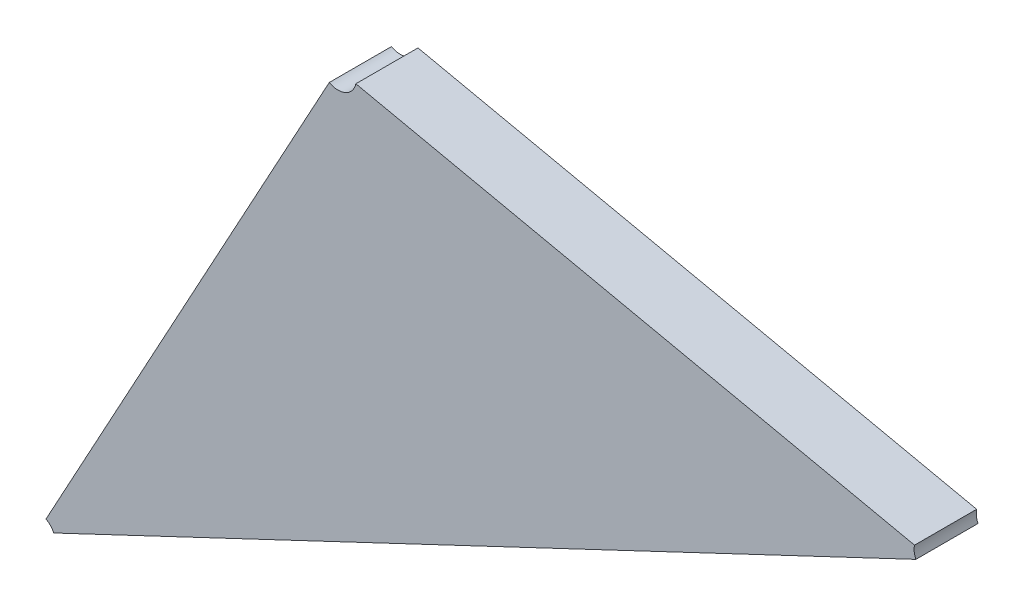
ISO-10303-21;
HEADER;
FILE_DESCRIPTION(('STEP AP214'),'2;1');
FILE_NAME('part.step','',(''),(''),'','','');
FILE_SCHEMA(('AUTOMOTIVE_DESIGN { 1 0 10303 214 1 1 1 1 }'));
ENDSEC;
DATA;
#1=APPLICATION_CONTEXT('core data for automotive mechanical design processes');
#2=APPLICATION_PROTOCOL_DEFINITION('international standard','automotive_design',2000,#1);
#3=PRODUCT_CONTEXT('',#1,'mechanical');
#4=PRODUCT('Part','Part','',(#3));
#5=PRODUCT_RELATED_PRODUCT_CATEGORY('part','',(#4));
#6=PRODUCT_DEFINITION_FORMATION('','',#4);
#7=PRODUCT_DEFINITION_CONTEXT('part definition',#1,'design');
#8=PRODUCT_DEFINITION('design','',#6,#7);
#9=PRODUCT_DEFINITION_SHAPE('','',#8);
#10=(LENGTH_UNIT() NAMED_UNIT(*) SI_UNIT(.MILLI.,.METRE.));
#11=(NAMED_UNIT(*) PLANE_ANGLE_UNIT() SI_UNIT($,.RADIAN.));
#12=(NAMED_UNIT(*) SI_UNIT($,.STERADIAN.) SOLID_ANGLE_UNIT());
#13=UNCERTAINTY_MEASURE_WITH_UNIT(LENGTH_MEASURE(1.E-05),#10,'distance_accuracy_value','');
#14=(GEOMETRIC_REPRESENTATION_CONTEXT(3) GLOBAL_UNCERTAINTY_ASSIGNED_CONTEXT((#13)) GLOBAL_UNIT_ASSIGNED_CONTEXT((#10,
#11,#12)) REPRESENTATION_CONTEXT('',''));
#15=CARTESIAN_POINT('',(0.,0.,0.));
#16=DIRECTION('',(0.,0.,1.));
#17=DIRECTION('',(1.,0.,0.));
#18=AXIS2_PLACEMENT_3D('',#15,#16,#17);
#19=CARTESIAN_POINT('',(-1.36985854212353,-1.36074278433117,0.0042));
#20=DIRECTION('',(0.,0.,1.));
#21=DIRECTION('',(1.,0.,0.));
#22=AXIS2_PLACEMENT_3D('',#19,#20,#21);
#23=PLANE('',#22);
#24=CARTESIAN_POINT('',(-1.37552796514819,-1.34730973343148,0.0042));
#25=DIRECTION('',(0.,0.,-1.));
#26=DIRECTION('',(0.977619939969203,-0.210378832049739,0.));
#27=AXIS2_PLACEMENT_3D('',#24,#25,#26);
#28=CIRCLE('',#27,0.000999999999999999);
#29=CARTESIAN_POINT('',(-1.37455034520822,-1.34752011226353,0.0042));
#30=VERTEX_POINT('',#29);
#31=CARTESIAN_POINT('',(-1.37600655354297,-1.34818777280894,0.0042));
#32=VERTEX_POINT('',#31);
#33=EDGE_CURVE('E11',#30,#32,#28,.T.);
#34=ORIENTED_EDGE('',*,*,#33,.T.);
#35=DIRECTION('',(-0.478588394782354,-0.878039377465299,0.));
#36=VECTOR('',#35,1.);
#37=CARTESIAN_POINT('',(-1.37600655354297,-1.34818777280894,0.0042));
#38=LINE('',#37,#36);
#39=CARTESIAN_POINT('',(-1.39151040841025,-1.37663182875428,0.0042));
#40=VERTEX_POINT('',#39);
#41=EDGE_CURVE('E34',#32,#40,#38,.T.);
#42=ORIENTED_EDGE('',*,*,#41,.T.);
#43=CARTESIAN_POINT('',(-1.39198899680504,-1.37750986813174,0.0042));
#44=DIRECTION('',(0.,0.,-1.));
#45=DIRECTION('',(0.478588394790645,0.87803937746078,0.));
#46=AXIS2_PLACEMENT_3D('',#43,#44,#45);
#47=CIRCLE('',#46,0.000999999999999994);
#48=CARTESIAN_POINT('',(-1.39108519040706,-1.37708192655281,0.0042));
#49=VERTEX_POINT('',#48);
#50=EDGE_CURVE('E86',#40,#49,#47,.T.);
#51=ORIENTED_EDGE('',*,*,#50,.T.);
#52=DIRECTION('',(0.903806397975919,0.42794157893081,0.));
#53=VECTOR('',#52,1.);
#54=CARTESIAN_POINT('',(-1.39108519040706,-1.37708192655281,0.0042));
#55=LINE('',#54,#53);
#56=CARTESIAN_POINT('',(-1.34389716330072,-1.35473895700564,0.0042));
#57=VERTEX_POINT('',#56);
#58=EDGE_CURVE('E105',#49,#57,#55,.T.);
#59=ORIENTED_EDGE('',*,*,#58,.T.);
#60=CARTESIAN_POINT('',(-1.34299335690274,-1.35431101542671,0.0042));
#61=DIRECTION('',(0.,0.,-1.));
#62=DIRECTION('',(-0.90380639797689,-0.427941578928759,0.));
#63=AXIS2_PLACEMENT_3D('',#60,#61,#62);
#64=CIRCLE('',#63,0.00100000000000002);
#65=CARTESIAN_POINT('',(-1.34397097684271,-1.35410063659466,0.0042));
#66=VERTEX_POINT('',#65);
#67=EDGE_CURVE('E110',#57,#66,#64,.T.);
#68=ORIENTED_EDGE('',*,*,#67,.T.);
#69=DIRECTION('',(-0.977619939969144,0.210378832050012,0.));
#70=VECTOR('',#69,1.);
#71=CARTESIAN_POINT('',(-1.34397097684271,-1.35410063659466,0.0042));
#72=LINE('',#71,#70);
#73=EDGE_CURVE('E85',#66,#30,#72,.T.);
#74=ORIENTED_EDGE('',*,*,#73,.T.);
#75=EDGE_LOOP('',(#34,#42,#51,#59,#68,#74));
#76=FACE_BOUND('',#75,.T.);
#77=ADVANCED_FACE('F17',(#76),#23,.T.);
#78=CARTESIAN_POINT('',(-1.37552796514819,-1.34730973343148,0.0012));
#79=DIRECTION('',(0.,0.,1.));
#80=DIRECTION('',(-1.,0.,0.));
#81=AXIS2_PLACEMENT_3D('',#78,#79,#80);
#82=CYLINDRICAL_SURFACE('',#81,0.000999999999999999);
#83=DIRECTION('',(0.,0.,-1.));
#84=VECTOR('',#83,1.);
#85=CARTESIAN_POINT('',(-1.37600655354297,-1.34818777280894,0.0042));
#86=LINE('',#85,#84);
#87=CARTESIAN_POINT('',(-1.37600655354297,-1.34818777280894,0.0008));
#88=VERTEX_POINT('',#87);
#89=EDGE_CURVE('E24',#32,#88,#86,.T.);
#90=ORIENTED_EDGE('',*,*,#89,.F.);
#91=ORIENTED_EDGE('',*,*,#33,.F.);
#92=DIRECTION('',(0.,0.,1.));
#93=VECTOR('',#92,1.);
#94=CARTESIAN_POINT('',(-1.37455034520822,-1.34752011226353,0.0008));
#95=LINE('',#94,#93);
#96=CARTESIAN_POINT('',(-1.37455034520822,-1.34752011226353,0.0008));
#97=VERTEX_POINT('',#96);
#98=EDGE_CURVE('E108',#97,#30,#95,.T.);
#99=ORIENTED_EDGE('',*,*,#98,.F.);
#100=CARTESIAN_POINT('',(-1.37552796514819,-1.34730973343148,0.0008));
#101=DIRECTION('',(0.,0.,1.));
#102=DIRECTION('',(-0.478588394782881,-0.878039377465012,0.));
#103=AXIS2_PLACEMENT_3D('',#100,#101,#102);
#104=CIRCLE('',#103,0.000999999999999999);
#105=EDGE_CURVE('E91',#88,#97,#104,.T.);
#106=ORIENTED_EDGE('',*,*,#105,.F.);
#107=EDGE_LOOP('',(#90,#91,#99,#106));
#108=FACE_BOUND('',#107,.T.);
#109=ADVANCED_FACE('F128',(#108),#82,.F.);
#110=CARTESIAN_POINT('',(-1.34299335690274,-1.35431101542671,0.0012));
#111=DIRECTION('',(0.,0.,1.));
#112=DIRECTION('',(-1.,0.,0.));
#113=AXIS2_PLACEMENT_3D('',#110,#111,#112);
#114=CYLINDRICAL_SURFACE('',#113,0.00100000000000002);
#115=DIRECTION('',(0.,0.,-1.));
#116=VECTOR('',#115,1.);
#117=CARTESIAN_POINT('',(-1.34397097684271,-1.35410063659466,0.0042));
#118=LINE('',#117,#116);
#119=CARTESIAN_POINT('',(-1.34397097684271,-1.35410063659466,0.0008));
#120=VERTEX_POINT('',#119);
#121=EDGE_CURVE('E68',#66,#120,#118,.T.);
#122=ORIENTED_EDGE('',*,*,#121,.F.);
#123=ORIENTED_EDGE('',*,*,#67,.F.);
#124=DIRECTION('',(0.,0.,1.));
#125=VECTOR('',#124,1.);
#126=CARTESIAN_POINT('',(-1.34389716330072,-1.35473895700564,0.0008));
#127=LINE('',#126,#125);
#128=CARTESIAN_POINT('',(-1.34389716330072,-1.35473895700564,0.0008));
#129=VERTEX_POINT('',#128);
#130=EDGE_CURVE('E71',#129,#57,#127,.T.);
#131=ORIENTED_EDGE('',*,*,#130,.F.);
#132=CARTESIAN_POINT('',(-1.34299335690274,-1.35431101542671,0.0008));
#133=DIRECTION('',(0.,0.,1.));
#134=DIRECTION('',(-0.977619939969193,0.210378832049784,0.));
#135=AXIS2_PLACEMENT_3D('',#132,#133,#134);
#136=CIRCLE('',#135,0.00100000000000002);
#137=EDGE_CURVE('E65',#120,#129,#136,.T.);
#138=ORIENTED_EDGE('',*,*,#137,.F.);
#139=EDGE_LOOP('',(#122,#123,#131,#138));
#140=FACE_BOUND('',#139,.T.);
#141=ADVANCED_FACE('F67',(#140),#114,.F.);
#142=CARTESIAN_POINT('',(-1.39198899680504,-1.37750986813174,0.0012));
#143=DIRECTION('',(0.,0.,1.));
#144=DIRECTION('',(-1.,0.,0.));
#145=AXIS2_PLACEMENT_3D('',#142,#143,#144);
#146=CYLINDRICAL_SURFACE('',#145,0.000999999999999994);
#147=DIRECTION('',(0.,0.,1.));
#148=VECTOR('',#147,1.);
#149=CARTESIAN_POINT('',(-1.39151040841025,-1.37663182875428,0.0008));
#150=LINE('',#149,#148);
#151=CARTESIAN_POINT('',(-1.39151040841025,-1.37663182875428,0.0008));
#152=VERTEX_POINT('',#151);
#153=EDGE_CURVE('E112',#152,#40,#150,.T.);
#154=ORIENTED_EDGE('',*,*,#153,.F.);
#155=CARTESIAN_POINT('',(-1.39198899680504,-1.37750986813174,0.0008));
#156=DIRECTION('',(0.,0.,1.));
#157=DIRECTION('',(0.903806397976976,0.427941578928578,0.));
#158=AXIS2_PLACEMENT_3D('',#155,#156,#157);
#159=CIRCLE('',#158,0.000999999999999994);
#160=CARTESIAN_POINT('',(-1.39108519040706,-1.37708192655281,0.0008));
#161=VERTEX_POINT('',#160);
#162=EDGE_CURVE('E102',#161,#152,#159,.T.);
#163=ORIENTED_EDGE('',*,*,#162,.F.);
#164=DIRECTION('',(0.,0.,1.));
#165=VECTOR('',#164,1.);
#166=CARTESIAN_POINT('',(-1.39108519040706,-1.37708192655281,0.0008));
#167=LINE('',#166,#165);
#168=EDGE_CURVE('E76',#161,#49,#167,.T.);
#169=ORIENTED_EDGE('',*,*,#168,.T.);
#170=ORIENTED_EDGE('',*,*,#50,.F.);
#171=EDGE_LOOP('',(#154,#163,#169,#170));
#172=FACE_BOUND('',#171,.T.);
#173=ADVANCED_FACE('F123',(#172),#146,.F.);
#174=CARTESIAN_POINT('',(-1.37552796514819,-1.34730973343148,0.0008));
#175=DIRECTION('',(-0.210378832050013,-0.977619939969144,0.));
#176=DIRECTION('',(0.977619939969144,-0.210378832050013,0.));
#177=AXIS2_PLACEMENT_3D('',#174,#175,#176);
#178=PLANE('',#177);
#179=ORIENTED_EDGE('',*,*,#98,.T.);
#180=ORIENTED_EDGE('',*,*,#73,.F.);
#181=ORIENTED_EDGE('',*,*,#121,.T.);
#182=DIRECTION('',(0.977619939969144,-0.210378832050013,0.));
#183=VECTOR('',#182,1.);
#184=CARTESIAN_POINT('',(-1.37455034520822,-1.34752011226353,0.0008));
#185=LINE('',#184,#183);
#186=EDGE_CURVE('E84',#97,#120,#185,.T.);
#187=ORIENTED_EDGE('',*,*,#186,.F.);
#188=EDGE_LOOP('',(#179,#180,#181,#187));
#189=FACE_BOUND('',#188,.T.);
#190=ADVANCED_FACE('F83',(#189),#178,.F.);
#191=CARTESIAN_POINT('',(-1.34299335690274,-1.35431101542671,0.0008));
#192=DIRECTION('',(-0.427941578930813,0.903806397975918,0.));
#193=DIRECTION('',(-0.903806397975918,-0.427941578930813,0.));
#194=AXIS2_PLACEMENT_3D('',#191,#192,#193);
#195=PLANE('',#194);
#196=ORIENTED_EDGE('',*,*,#130,.T.);
#197=ORIENTED_EDGE('',*,*,#58,.F.);
#198=ORIENTED_EDGE('',*,*,#168,.F.);
#199=DIRECTION('',(-0.903806397975918,-0.427941578930813,0.));
#200=VECTOR('',#199,1.);
#201=CARTESIAN_POINT('',(-1.34389716330072,-1.35473895700564,0.0008));
#202=LINE('',#201,#200);
#203=EDGE_CURVE('E92',#129,#161,#202,.T.);
#204=ORIENTED_EDGE('',*,*,#203,.F.);
#205=EDGE_LOOP('',(#196,#197,#198,#204));
#206=FACE_BOUND('',#205,.T.);
#207=ADVANCED_FACE('F126',(#206),#195,.F.);
#208=CARTESIAN_POINT('',(-1.39198899680504,-1.37750986813174,0.0008));
#209=DIRECTION('',(0.878039377465294,-0.478588394782364,0.));
#210=DIRECTION('',(0.478588394782364,0.878039377465294,0.));
#211=AXIS2_PLACEMENT_3D('',#208,#209,#210);
#212=PLANE('',#211);
#213=ORIENTED_EDGE('',*,*,#89,.T.);
#214=DIRECTION('',(0.478588394782371,0.87803937746529,0.));
#215=VECTOR('',#214,1.);
#216=CARTESIAN_POINT('',(-1.39151040841026,-1.37663182875428,0.0008));
#217=LINE('',#216,#215);
#218=EDGE_CURVE('E77',#152,#88,#217,.T.);
#219=ORIENTED_EDGE('',*,*,#218,.F.);
#220=ORIENTED_EDGE('',*,*,#153,.T.);
#221=ORIENTED_EDGE('',*,*,#41,.F.);
#222=EDGE_LOOP('',(#213,#219,#220,#221));
#223=FACE_BOUND('',#222,.T.);
#224=ADVANCED_FACE('F119',(#223),#212,.F.);
#225=CARTESIAN_POINT('',(-1.36983443018464,-1.36079966347413,0.0008));
#226=DIRECTION('',(0.,0.,-1.));
#227=DIRECTION('',(-1.,0.,0.));
#228=AXIS2_PLACEMENT_3D('',#225,#226,#227);
#229=PLANE('',#228);
#230=ORIENTED_EDGE('',*,*,#105,.T.);
#231=ORIENTED_EDGE('',*,*,#186,.T.);
#232=ORIENTED_EDGE('',*,*,#137,.T.);
#233=ORIENTED_EDGE('',*,*,#203,.T.);
#234=ORIENTED_EDGE('',*,*,#162,.T.);
#235=ORIENTED_EDGE('',*,*,#218,.T.);
#236=EDGE_LOOP('',(#230,#231,#232,#233,#234,#235));
#237=FACE_BOUND('',#236,.T.);
#238=ADVANCED_FACE('F89',(#237),#229,.T.);
#239=CLOSED_SHELL('',(#77,#109,#141,#173,#190,#207,#224,#238));
#240=MANIFOLD_SOLID_BREP('B1',#239);
#241=ADVANCED_BREP_SHAPE_REPRESENTATION('',(#18,#240),#14);
#242=SHAPE_DEFINITION_REPRESENTATION(#9,#241);
ENDSEC;
END-ISO-10303-21;
